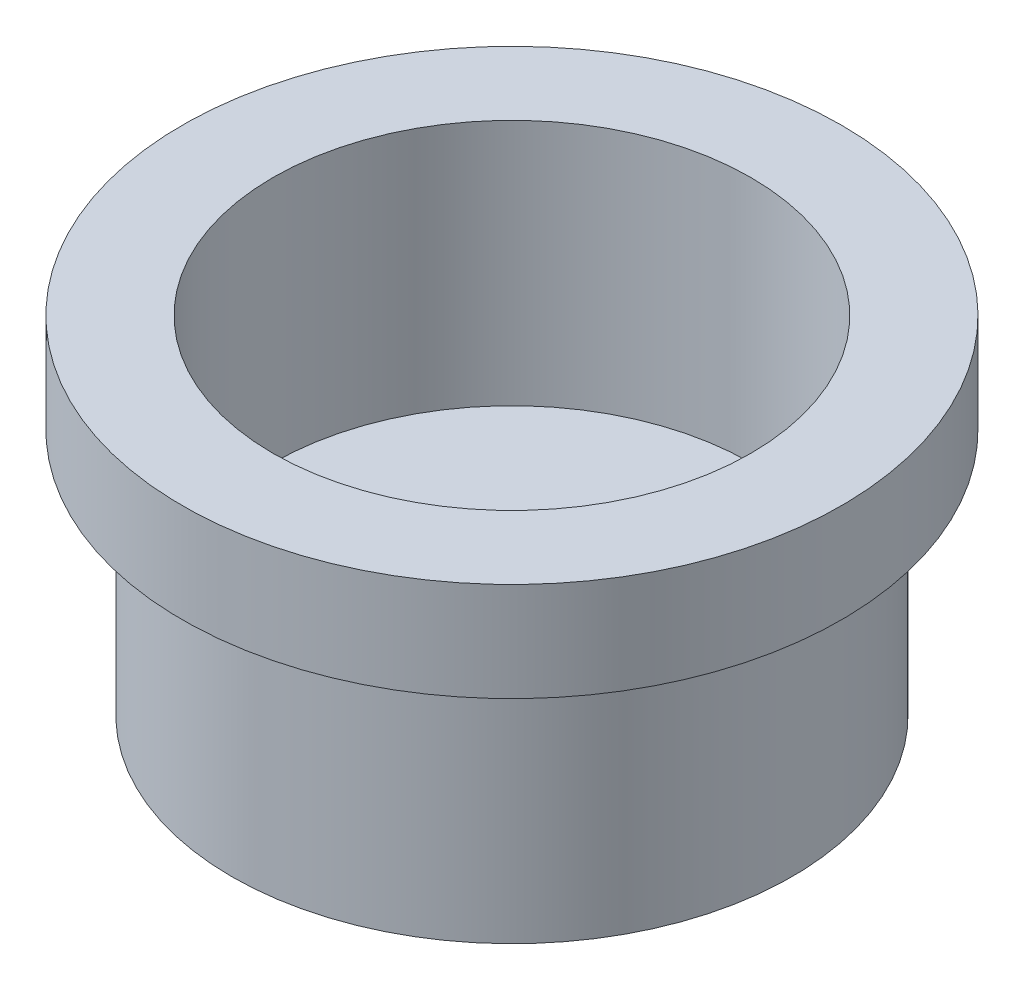
ISO-10303-21;
HEADER;
FILE_DESCRIPTION(('STEP AP214'),'2;1');
FILE_NAME('part.step','',(''),(''),'','','');
FILE_SCHEMA(('AUTOMOTIVE_DESIGN { 1 0 10303 214 1 1 1 1 }'));
ENDSEC;
DATA;
#1=APPLICATION_CONTEXT('core data for automotive mechanical design processes');
#2=APPLICATION_PROTOCOL_DEFINITION('international standard','automotive_design',2000,#1);
#3=PRODUCT_CONTEXT('',#1,'mechanical');
#4=PRODUCT('Part','Part','',(#3));
#5=PRODUCT_RELATED_PRODUCT_CATEGORY('part','',(#4));
#6=PRODUCT_DEFINITION_FORMATION('','',#4);
#7=PRODUCT_DEFINITION_CONTEXT('part definition',#1,'design');
#8=PRODUCT_DEFINITION('design','',#6,#7);
#9=PRODUCT_DEFINITION_SHAPE('','',#8);
#10=(LENGTH_UNIT() NAMED_UNIT(*) SI_UNIT(.MILLI.,.METRE.));
#11=(NAMED_UNIT(*) PLANE_ANGLE_UNIT() SI_UNIT($,.RADIAN.));
#12=(NAMED_UNIT(*) SI_UNIT($,.STERADIAN.) SOLID_ANGLE_UNIT());
#13=UNCERTAINTY_MEASURE_WITH_UNIT(LENGTH_MEASURE(1.E-05),#10,'distance_accuracy_value','');
#14=(GEOMETRIC_REPRESENTATION_CONTEXT(3) GLOBAL_UNCERTAINTY_ASSIGNED_CONTEXT((#13)) GLOBAL_UNIT_ASSIGNED_CONTEXT((#10,
#11,#12)) REPRESENTATION_CONTEXT('',''));
#15=CARTESIAN_POINT('',(0.,0.,0.));
#16=DIRECTION('',(0.,0.,1.));
#17=DIRECTION('',(1.,0.,0.));
#18=AXIS2_PLACEMENT_3D('',#15,#16,#17);
#19=CARTESIAN_POINT('',(-4.5,0.,0.));
#20=DIRECTION('',(0.,1.,0.));
#21=DIRECTION('',(0.,0.,1.));
#22=AXIS2_PLACEMENT_3D('',#19,#20,#21);
#23=PLANE('',#22);
#24=CARTESIAN_POINT('',(0.,0.,0.));
#25=DIRECTION('',(0.,-1.,0.));
#26=DIRECTION('',(0.,0.,-1.));
#27=AXIS2_PLACEMENT_3D('',#24,#25,#26);
#28=CIRCLE('',#27,2.5);
#29=CARTESIAN_POINT('',(0.,0.,-2.5));
#30=VERTEX_POINT('',#29);
#31=EDGE_CURVE('E10',#30,#30,#28,.T.);
#32=ORIENTED_EDGE('',*,*,#31,.F.);
#33=EDGE_LOOP('',(#32));
#34=FACE_BOUND('',#33,.T.);
#35=CARTESIAN_POINT('',(0.,0.,0.));
#36=DIRECTION('',(0.,-1.,0.));
#37=DIRECTION('',(0.,0.,-1.));
#38=AXIS2_PLACEMENT_3D('',#35,#36,#37);
#39=CIRCLE('',#38,4.5);
#40=CARTESIAN_POINT('',(0.,0.,-4.5));
#41=VERTEX_POINT('',#40);
#42=EDGE_CURVE('E96',#41,#41,#39,.T.);
#43=ORIENTED_EDGE('',*,*,#42,.T.);
#44=EDGE_LOOP('',(#43));
#45=FACE_BOUND('',#44,.T.);
#46=ADVANCED_FACE('F37',(#34,#45),#23,.F.);
#47=CARTESIAN_POINT('',(0.,0.,0.));
#48=DIRECTION('',(0.,-1.,0.));
#49=DIRECTION('',(0.,0.,-1.));
#50=AXIS2_PLACEMENT_3D('',#47,#48,#49);
#51=CYLINDRICAL_SURFACE('',#50,2.5);
#52=CARTESIAN_POINT('',(0.,8.,0.));
#53=DIRECTION('',(0.,-1.,0.));
#54=DIRECTION('',(0.,0.,-1.));
#55=AXIS2_PLACEMENT_3D('',#52,#53,#54);
#56=CIRCLE('',#55,2.5);
#57=CARTESIAN_POINT('',(0.,8.,-2.5));
#58=VERTEX_POINT('',#57);
#59=EDGE_CURVE('E44',#58,#58,#56,.T.);
#60=ORIENTED_EDGE('',*,*,#59,.F.);
#61=EDGE_LOOP('',(#60));
#62=FACE_BOUND('',#61,.T.);
#63=ORIENTED_EDGE('',*,*,#31,.T.);
#64=EDGE_LOOP('',(#63));
#65=FACE_BOUND('',#64,.T.);
#66=ADVANCED_FACE('F170',(#62,#65),#51,.F.);
#67=CARTESIAN_POINT('',(-2.5,8.,0.));
#68=DIRECTION('',(0.,-1.,0.));
#69=DIRECTION('',(0.,0.,-1.));
#70=AXIS2_PLACEMENT_3D('',#67,#68,#69);
#71=PLANE('',#70);
#72=CARTESIAN_POINT('',(0.,8.,0.));
#73=DIRECTION('',(0.,-1.,0.));
#74=DIRECTION('',(0.,0.,-1.));
#75=AXIS2_PLACEMENT_3D('',#72,#73,#74);
#76=CIRCLE('',#75,4.7);
#77=CARTESIAN_POINT('',(0.,8.,-4.7));
#78=VERTEX_POINT('',#77);
#79=EDGE_CURVE('E49',#78,#78,#76,.T.);
#80=ORIENTED_EDGE('',*,*,#79,.F.);
#81=EDGE_LOOP('',(#80));
#82=FACE_BOUND('',#81,.T.);
#83=ORIENTED_EDGE('',*,*,#59,.T.);
#84=EDGE_LOOP('',(#83));
#85=FACE_BOUND('',#84,.T.);
#86=ADVANCED_FACE('F165',(#82,#85),#71,.F.);
#87=CARTESIAN_POINT('',(0.,0.,0.));
#88=DIRECTION('',(0.,-1.,0.));
#89=DIRECTION('',(0.,0.,-1.));
#90=AXIS2_PLACEMENT_3D('',#87,#88,#89);
#91=CYLINDRICAL_SURFACE('',#90,4.7);
#92=CARTESIAN_POINT('',(0.,12.,0.));
#93=DIRECTION('',(0.,-1.,0.));
#94=DIRECTION('',(0.,0.,-1.));
#95=AXIS2_PLACEMENT_3D('',#92,#93,#94);
#96=CIRCLE('',#95,4.7);
#97=CARTESIAN_POINT('',(0.,12.,-4.7));
#98=VERTEX_POINT('',#97);
#99=EDGE_CURVE('E54',#98,#98,#96,.T.);
#100=ORIENTED_EDGE('',*,*,#99,.F.);
#101=EDGE_LOOP('',(#100));
#102=FACE_BOUND('',#101,.T.);
#103=ORIENTED_EDGE('',*,*,#79,.T.);
#104=EDGE_LOOP('',(#103));
#105=FACE_BOUND('',#104,.T.);
#106=ADVANCED_FACE('F159',(#102,#105),#91,.F.);
#107=CARTESIAN_POINT('',(-4.7,12.,0.));
#108=DIRECTION('',(0.,-1.,0.));
#109=DIRECTION('',(0.,0.,-1.));
#110=AXIS2_PLACEMENT_3D('',#107,#108,#109);
#111=PLANE('',#110);
#112=CARTESIAN_POINT('',(0.,12.,0.));
#113=DIRECTION('',(0.,-1.,0.));
#114=DIRECTION('',(0.,0.,-1.));
#115=AXIS2_PLACEMENT_3D('',#112,#113,#114);
#116=CIRCLE('',#115,14.5);
#117=CARTESIAN_POINT('',(0.,12.,-14.5));
#118=VERTEX_POINT('',#117);
#119=EDGE_CURVE('E60',#118,#118,#116,.T.);
#120=ORIENTED_EDGE('',*,*,#119,.F.);
#121=EDGE_LOOP('',(#120));
#122=FACE_BOUND('',#121,.T.);
#123=ORIENTED_EDGE('',*,*,#99,.T.);
#124=EDGE_LOOP('',(#123));
#125=FACE_BOUND('',#124,.T.);
#126=ADVANCED_FACE('F153',(#122,#125),#111,.F.);
#127=CARTESIAN_POINT('',(0.,0.,0.));
#128=DIRECTION('',(0.,-1.,0.));
#129=DIRECTION('',(0.,0.,-1.));
#130=AXIS2_PLACEMENT_3D('',#127,#128,#129);
#131=CYLINDRICAL_SURFACE('',#130,14.5);
#132=CARTESIAN_POINT('',(0.,27.,0.));
#133=DIRECTION('',(0.,-1.,0.));
#134=DIRECTION('',(0.,0.,-1.));
#135=AXIS2_PLACEMENT_3D('',#132,#133,#134);
#136=CIRCLE('',#135,14.5);
#137=CARTESIAN_POINT('',(0.,27.,-14.5));
#138=VERTEX_POINT('',#137);
#139=EDGE_CURVE('E64',#138,#138,#136,.T.);
#140=ORIENTED_EDGE('',*,*,#139,.F.);
#141=EDGE_LOOP('',(#140));
#142=FACE_BOUND('',#141,.T.);
#143=ORIENTED_EDGE('',*,*,#119,.T.);
#144=EDGE_LOOP('',(#143));
#145=FACE_BOUND('',#144,.T.);
#146=ADVANCED_FACE('F147',(#142,#145),#131,.F.);
#147=CARTESIAN_POINT('',(-14.5,27.,0.));
#148=DIRECTION('',(0.,-1.,0.));
#149=DIRECTION('',(0.,0.,-1.));
#150=AXIS2_PLACEMENT_3D('',#147,#148,#149);
#151=PLANE('',#150);
#152=CARTESIAN_POINT('',(0.,27.,0.));
#153=DIRECTION('',(0.,-1.,0.));
#154=DIRECTION('',(0.,0.,-1.));
#155=AXIS2_PLACEMENT_3D('',#152,#153,#154);
#156=CIRCLE('',#155,20.);
#157=CARTESIAN_POINT('',(0.,27.,-20.));
#158=VERTEX_POINT('',#157);
#159=EDGE_CURVE('E68',#158,#158,#156,.T.);
#160=ORIENTED_EDGE('',*,*,#159,.F.);
#161=EDGE_LOOP('',(#160));
#162=FACE_BOUND('',#161,.T.);
#163=ORIENTED_EDGE('',*,*,#139,.T.);
#164=EDGE_LOOP('',(#163));
#165=FACE_BOUND('',#164,.T.);
#166=ADVANCED_FACE('F141',(#162,#165),#151,.F.);
#167=CARTESIAN_POINT('',(0.,0.,0.));
#168=DIRECTION('',(0.,-1.,0.));
#169=DIRECTION('',(0.,0.,-1.));
#170=AXIS2_PLACEMENT_3D('',#167,#168,#169);
#171=CYLINDRICAL_SURFACE('',#170,20.);
#172=CARTESIAN_POINT('',(0.,21.,0.));
#173=DIRECTION('',(0.,-1.,0.));
#174=DIRECTION('',(0.,0.,-1.));
#175=AXIS2_PLACEMENT_3D('',#172,#173,#174);
#176=CIRCLE('',#175,20.);
#177=CARTESIAN_POINT('',(0.,21.,-20.));
#178=VERTEX_POINT('',#177);
#179=EDGE_CURVE('E72',#178,#178,#176,.T.);
#180=ORIENTED_EDGE('',*,*,#179,.F.);
#181=EDGE_LOOP('',(#180));
#182=FACE_BOUND('',#181,.T.);
#183=ORIENTED_EDGE('',*,*,#159,.T.);
#184=EDGE_LOOP('',(#183));
#185=FACE_BOUND('',#184,.T.);
#186=ADVANCED_FACE('F135',(#182,#185),#171,.T.);
#187=CARTESIAN_POINT('',(-20.,21.,0.));
#188=DIRECTION('',(0.,1.,0.));
#189=DIRECTION('',(0.,0.,1.));
#190=AXIS2_PLACEMENT_3D('',#187,#188,#189);
#191=PLANE('',#190);
#192=CARTESIAN_POINT('',(0.,21.,0.));
#193=DIRECTION('',(0.,-1.,0.));
#194=DIRECTION('',(0.,0.,-1.));
#195=AXIS2_PLACEMENT_3D('',#192,#193,#194);
#196=CIRCLE('',#195,17.);
#197=CARTESIAN_POINT('',(0.,21.,-17.));
#198=VERTEX_POINT('',#197);
#199=EDGE_CURVE('E76',#198,#198,#196,.T.);
#200=ORIENTED_EDGE('',*,*,#199,.F.);
#201=EDGE_LOOP('',(#200));
#202=FACE_BOUND('',#201,.T.);
#203=ORIENTED_EDGE('',*,*,#179,.T.);
#204=EDGE_LOOP('',(#203));
#205=FACE_BOUND('',#204,.T.);
#206=ADVANCED_FACE('F129',(#202,#205),#191,.F.);
#207=CARTESIAN_POINT('',(0.,0.,0.));
#208=DIRECTION('',(0.,-1.,0.));
#209=DIRECTION('',(0.,0.,-1.));
#210=AXIS2_PLACEMENT_3D('',#207,#208,#209);
#211=CYLINDRICAL_SURFACE('',#210,17.);
#212=CARTESIAN_POINT('',(0.,6.,0.));
#213=DIRECTION('',(0.,-1.,0.));
#214=DIRECTION('',(0.,0.,-1.));
#215=AXIS2_PLACEMENT_3D('',#212,#213,#214);
#216=CIRCLE('',#215,17.);
#217=CARTESIAN_POINT('',(0.,6.,-17.));
#218=VERTEX_POINT('',#217);
#219=EDGE_CURVE('E80',#218,#218,#216,.T.);
#220=ORIENTED_EDGE('',*,*,#219,.F.);
#221=EDGE_LOOP('',(#220));
#222=FACE_BOUND('',#221,.T.);
#223=ORIENTED_EDGE('',*,*,#199,.T.);
#224=EDGE_LOOP('',(#223));
#225=FACE_BOUND('',#224,.T.);
#226=ADVANCED_FACE('F123',(#222,#225),#211,.T.);
#227=CARTESIAN_POINT('',(-17.,6.,0.));
#228=DIRECTION('',(0.,1.,0.));
#229=DIRECTION('',(0.,0.,1.));
#230=AXIS2_PLACEMENT_3D('',#227,#228,#229);
#231=PLANE('',#230);
#232=CARTESIAN_POINT('',(0.,6.,0.));
#233=DIRECTION('',(0.,-1.,0.));
#234=DIRECTION('',(0.,0.,-1.));
#235=AXIS2_PLACEMENT_3D('',#232,#233,#234);
#236=CIRCLE('',#235,6.5);
#237=CARTESIAN_POINT('',(0.,6.,-6.5));
#238=VERTEX_POINT('',#237);
#239=EDGE_CURVE('E84',#238,#238,#236,.T.);
#240=ORIENTED_EDGE('',*,*,#239,.F.);
#241=EDGE_LOOP('',(#240));
#242=FACE_BOUND('',#241,.T.);
#243=ORIENTED_EDGE('',*,*,#219,.T.);
#244=EDGE_LOOP('',(#243));
#245=FACE_BOUND('',#244,.T.);
#246=ADVANCED_FACE('F117',(#242,#245),#231,.F.);
#247=CARTESIAN_POINT('',(0.,0.,0.));
#248=DIRECTION('',(0.,-1.,0.));
#249=DIRECTION('',(0.,0.,-1.));
#250=AXIS2_PLACEMENT_3D('',#247,#248,#249);
#251=CYLINDRICAL_SURFACE('',#250,6.5);
#252=CARTESIAN_POINT('',(0.,5.,0.));
#253=DIRECTION('',(0.,-1.,0.));
#254=DIRECTION('',(0.,0.,-1.));
#255=AXIS2_PLACEMENT_3D('',#252,#253,#254);
#256=CIRCLE('',#255,6.5);
#257=CARTESIAN_POINT('',(0.,5.,-6.5));
#258=VERTEX_POINT('',#257);
#259=EDGE_CURVE('E88',#258,#258,#256,.T.);
#260=ORIENTED_EDGE('',*,*,#259,.F.);
#261=EDGE_LOOP('',(#260));
#262=FACE_BOUND('',#261,.T.);
#263=ORIENTED_EDGE('',*,*,#239,.T.);
#264=EDGE_LOOP('',(#263));
#265=FACE_BOUND('',#264,.T.);
#266=ADVANCED_FACE('F111',(#262,#265),#251,.T.);
#267=CARTESIAN_POINT('',(-6.5,5.,0.));
#268=DIRECTION('',(0.,1.,0.));
#269=DIRECTION('',(0.,0.,1.));
#270=AXIS2_PLACEMENT_3D('',#267,#268,#269);
#271=PLANE('',#270);
#272=CARTESIAN_POINT('',(0.,5.,0.));
#273=DIRECTION('',(0.,-1.,0.));
#274=DIRECTION('',(0.,0.,-1.));
#275=AXIS2_PLACEMENT_3D('',#272,#273,#274);
#276=CIRCLE('',#275,4.5);
#277=CARTESIAN_POINT('',(0.,5.,-4.5));
#278=VERTEX_POINT('',#277);
#279=EDGE_CURVE('E92',#278,#278,#276,.T.);
#280=ORIENTED_EDGE('',*,*,#279,.F.);
#281=EDGE_LOOP('',(#280));
#282=FACE_BOUND('',#281,.T.);
#283=ORIENTED_EDGE('',*,*,#259,.T.);
#284=EDGE_LOOP('',(#283));
#285=FACE_BOUND('',#284,.T.);
#286=ADVANCED_FACE('F105',(#282,#285),#271,.F.);
#287=CARTESIAN_POINT('',(0.,0.,0.));
#288=DIRECTION('',(0.,-1.,0.));
#289=DIRECTION('',(0.,0.,-1.));
#290=AXIS2_PLACEMENT_3D('',#287,#288,#289);
#291=CYLINDRICAL_SURFACE('',#290,4.5);
#292=ORIENTED_EDGE('',*,*,#42,.F.);
#293=EDGE_LOOP('',(#292));
#294=FACE_BOUND('',#293,.T.);
#295=ORIENTED_EDGE('',*,*,#279,.T.);
#296=EDGE_LOOP('',(#295));
#297=FACE_BOUND('',#296,.T.);
#298=ADVANCED_FACE('F102',(#294,#297),#291,.T.);
#299=CLOSED_SHELL('',(#46,#66,#86,#106,#126,#146,#166,#186,#206,#226,#246,#266,#286,#298));
#300=MANIFOLD_SOLID_BREP('B2',#299);
#301=ADVANCED_BREP_SHAPE_REPRESENTATION('',(#18,#300),#14);
#302=SHAPE_DEFINITION_REPRESENTATION(#9,#301);
ENDSEC;
END-ISO-10303-21;
